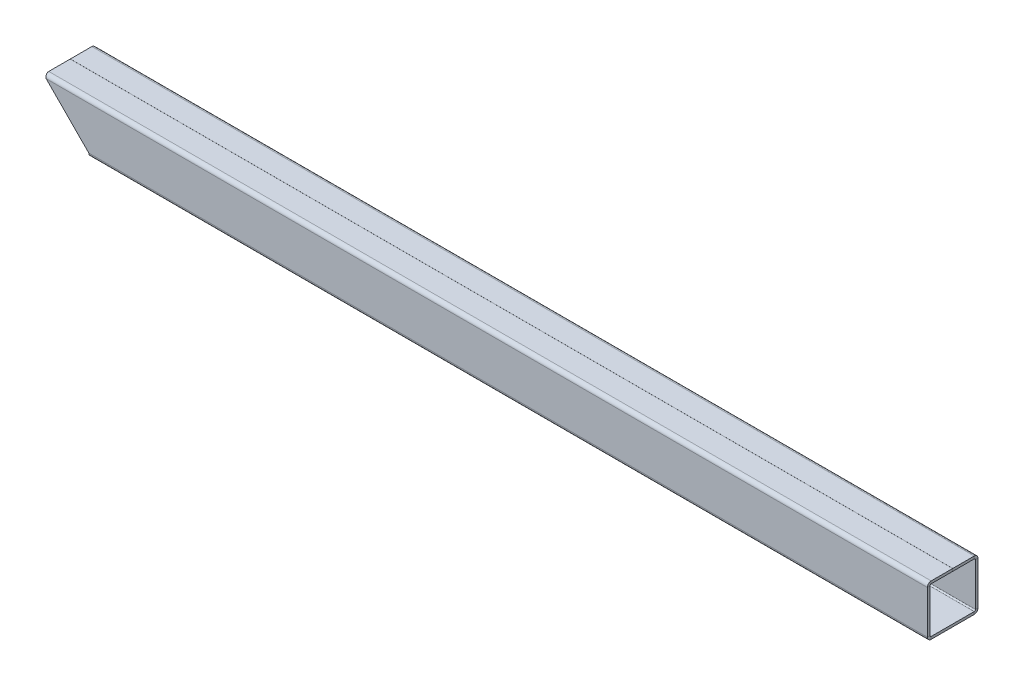
ISO-10303-21;
HEADER;
FILE_DESCRIPTION(('STEP AP214'),'2;1');
FILE_NAME('part.step','',(''),(''),'','','');
FILE_SCHEMA(('AUTOMOTIVE_DESIGN { 1 0 10303 214 1 1 1 1 }'));
ENDSEC;
DATA;
#1=APPLICATION_CONTEXT('core data for automotive mechanical design processes');
#2=APPLICATION_PROTOCOL_DEFINITION('international standard','automotive_design',2000,#1);
#3=PRODUCT_CONTEXT('',#1,'mechanical');
#4=PRODUCT('Part','Part','',(#3));
#5=PRODUCT_RELATED_PRODUCT_CATEGORY('part','',(#4));
#6=PRODUCT_DEFINITION_FORMATION('','',#4);
#7=PRODUCT_DEFINITION_CONTEXT('part definition',#1,'design');
#8=PRODUCT_DEFINITION('design','',#6,#7);
#9=PRODUCT_DEFINITION_SHAPE('','',#8);
#10=(LENGTH_UNIT() NAMED_UNIT(*) SI_UNIT(.MILLI.,.METRE.));
#11=(NAMED_UNIT(*) PLANE_ANGLE_UNIT() SI_UNIT($,.RADIAN.));
#12=(NAMED_UNIT(*) SI_UNIT($,.STERADIAN.) SOLID_ANGLE_UNIT());
#13=UNCERTAINTY_MEASURE_WITH_UNIT(LENGTH_MEASURE(1.E-05),#10,'distance_accuracy_value','');
#14=(GEOMETRIC_REPRESENTATION_CONTEXT(3) GLOBAL_UNCERTAINTY_ASSIGNED_CONTEXT((#13)) GLOBAL_UNIT_ASSIGNED_CONTEXT((#10,
#11,#12)) REPRESENTATION_CONTEXT('',''));
#15=CARTESIAN_POINT('',(0.,0.,0.));
#16=DIRECTION('',(0.,0.,1.));
#17=DIRECTION('',(1.,0.,0.));
#18=AXIS2_PLACEMENT_3D('',#15,#16,#17);
#19=CARTESIAN_POINT('',(349.75,18.,20.));
#20=DIRECTION('',(0.,1.,0.));
#21=DIRECTION('',(0.,0.,1.));
#22=AXIS2_PLACEMENT_3D('',#19,#20,#21);
#23=PLANE('',#22);
#24=DIRECTION('',(0.,0.,-1.));
#25=VECTOR('',#24,1.);
#26=CARTESIAN_POINT('',(-347.371621621622,18.,19.9999999999998));
#27=LINE('',#26,#25);
#28=CARTESIAN_POINT('',(-347.371621621622,18.,17.));
#29=VERTEX_POINT('',#28);
#30=CARTESIAN_POINT('',(-347.371621621622,18.,0.0249999999999938));
#31=VERTEX_POINT('',#30);
#32=EDGE_CURVE('E190',#29,#31,#27,.T.);
#33=ORIENTED_EDGE('',*,*,#32,.T.);
#34=DIRECTION('',(-1.,0.,0.));
#35=VECTOR('',#34,1.);
#36=CARTESIAN_POINT('',(349.75,18.,0.0249999999999938));
#37=LINE('',#36,#35);
#38=CARTESIAN_POINT('',(349.75,18.,0.0249999999999938));
#39=VERTEX_POINT('',#38);
#40=EDGE_CURVE('E266',#39,#31,#37,.T.);
#41=ORIENTED_EDGE('',*,*,#40,.F.);
#42=DIRECTION('',(0.,0.,-1.));
#43=VECTOR('',#42,1.);
#44=CARTESIAN_POINT('',(349.75,18.,20.));
#45=LINE('',#44,#43);
#46=CARTESIAN_POINT('',(349.75,18.,17.));
#47=VERTEX_POINT('',#46);
#48=EDGE_CURVE('E201',#47,#39,#45,.T.);
#49=ORIENTED_EDGE('',*,*,#48,.F.);
#50=DIRECTION('',(-1.,0.,0.));
#51=VECTOR('',#50,1.);
#52=CARTESIAN_POINT('',(349.75,18.,17.));
#53=LINE('',#52,#51);
#54=EDGE_CURVE('E349',#47,#29,#53,.T.);
#55=ORIENTED_EDGE('',*,*,#54,.T.);
#56=EDGE_LOOP('',(#33,#41,#49,#55));
#57=FACE_BOUND('',#56,.T.);
#58=ADVANCED_FACE('F42',(#57),#23,.F.);
#59=CARTESIAN_POINT('',(349.75,20.,0.0249999999999929));
#60=DIRECTION('',(0.,0.,-1.));
#61=DIRECTION('',(0.,1.,0.));
#62=AXIS2_PLACEMENT_3D('',#59,#60,#61);
#63=PLANE('',#62);
#64=ORIENTED_EDGE('',*,*,#40,.T.);
#65=DIRECTION('',(0.,-1.,0.));
#66=VECTOR('',#65,1.);
#67=CARTESIAN_POINT('',(-347.371621621622,18.,0.0249999999999938));
#68=LINE('',#67,#66);
#69=CARTESIAN_POINT('',(-347.371621621622,20.,0.0249999999999938));
#70=VERTEX_POINT('',#69);
#71=EDGE_CURVE('E368',#31,#70,#68,.F.);
#72=ORIENTED_EDGE('',*,*,#71,.T.);
#73=DIRECTION('',(-1.,0.,0.));
#74=VECTOR('',#73,1.);
#75=CARTESIAN_POINT('',(349.75,20.,0.0249999999999929));
#76=LINE('',#75,#74);
#77=CARTESIAN_POINT('',(349.75,20.,0.0249999999999929));
#78=VERTEX_POINT('',#77);
#79=EDGE_CURVE('E263',#78,#70,#76,.T.);
#80=ORIENTED_EDGE('',*,*,#79,.F.);
#81=DIRECTION('',(0.,-1.,0.));
#82=VECTOR('',#81,1.);
#83=CARTESIAN_POINT('',(349.75,20.,0.0249999999999929));
#84=LINE('',#83,#82);
#85=EDGE_CURVE('E387',#78,#39,#84,.T.);
#86=ORIENTED_EDGE('',*,*,#85,.T.);
#87=EDGE_LOOP('',(#64,#72,#80,#86));
#88=FACE_BOUND('',#87,.T.);
#89=ADVANCED_FACE('F398',(#88),#63,.T.);
#90=CARTESIAN_POINT('',(349.75,20.,20.));
#91=DIRECTION('',(0.,1.,0.));
#92=DIRECTION('',(0.,0.,1.));
#93=AXIS2_PLACEMENT_3D('',#90,#91,#92);
#94=PLANE('',#93);
#95=ORIENTED_EDGE('',*,*,#79,.T.);
#96=DIRECTION('',(0.,0.,1.));
#97=VECTOR('',#96,1.);
#98=CARTESIAN_POINT('',(-347.371621621622,20.,20.));
#99=LINE('',#98,#97);
#100=CARTESIAN_POINT('',(-347.371621621622,20.,17.));
#101=VERTEX_POINT('',#100);
#102=EDGE_CURVE('E376',#101,#70,#99,.F.);
#103=ORIENTED_EDGE('',*,*,#102,.F.);
#104=DIRECTION('',(-1.,0.,0.));
#105=VECTOR('',#104,1.);
#106=CARTESIAN_POINT('',(349.75,20.,17.));
#107=LINE('',#106,#105);
#108=CARTESIAN_POINT('',(349.75,20.,17.));
#109=VERTEX_POINT('',#108);
#110=EDGE_CURVE('E260',#109,#101,#107,.T.);
#111=ORIENTED_EDGE('',*,*,#110,.F.);
#112=DIRECTION('',(0.,0.,-1.));
#113=VECTOR('',#112,1.);
#114=CARTESIAN_POINT('',(349.75,20.,20.));
#115=LINE('',#114,#113);
#116=EDGE_CURVE('E303',#109,#78,#115,.T.);
#117=ORIENTED_EDGE('',*,*,#116,.T.);
#118=EDGE_LOOP('',(#95,#103,#111,#117));
#119=FACE_BOUND('',#118,.T.);
#120=ADVANCED_FACE('F391',(#119),#94,.T.);
#121=CARTESIAN_POINT('',(349.75,17.,17.));
#122=DIRECTION('',(-1.,0.,0.));
#123=DIRECTION('',(0.,0.,1.));
#124=AXIS2_PLACEMENT_3D('',#121,#122,#123);
#125=CYLINDRICAL_SURFACE('',#124,3.);
#126=ORIENTED_EDGE('',*,*,#110,.T.);
#127=CARTESIAN_POINT('',(-346.382432432432,17.,17.));
#128=DIRECTION('',(0.949705005976395,0.313145974943596,0.));
#129=DIRECTION('',(-0.313145974943596,0.949705005976395,0.));
#130=AXIS2_PLACEMENT_3D('',#127,#128,#129);
#131=ELLIPSE('',#130,3.15887563098153,3.);
#132=CARTESIAN_POINT('',(-346.382432432432,17.,20.));
#133=VERTEX_POINT('',#132);
#134=EDGE_CURVE('E299',#133,#101,#131,.F.);
#135=ORIENTED_EDGE('',*,*,#134,.F.);
#136=DIRECTION('',(-1.,0.,0.));
#137=VECTOR('',#136,1.);
#138=CARTESIAN_POINT('',(349.75,17.,20.));
#139=LINE('',#138,#137);
#140=CARTESIAN_POINT('',(349.75,17.,20.));
#141=VERTEX_POINT('',#140);
#142=EDGE_CURVE('E257',#141,#133,#139,.T.);
#143=ORIENTED_EDGE('',*,*,#142,.F.);
#144=CARTESIAN_POINT('',(349.75,17.,17.));
#145=DIRECTION('',(-1.,0.,0.));
#146=DIRECTION('',(0.,0.,1.));
#147=AXIS2_PLACEMENT_3D('',#144,#145,#146);
#148=CIRCLE('',#147,3.);
#149=EDGE_CURVE('E298',#141,#109,#148,.T.);
#150=ORIENTED_EDGE('',*,*,#149,.T.);
#151=EDGE_LOOP('',(#126,#135,#143,#150));
#152=FACE_BOUND('',#151,.T.);
#153=ADVANCED_FACE('F297',(#152),#125,.T.);
#154=CARTESIAN_POINT('',(349.75,20.,20.));
#155=DIRECTION('',(0.,0.,1.));
#156=DIRECTION('',(0.,-1.,0.));
#157=AXIS2_PLACEMENT_3D('',#154,#155,#156);
#158=PLANE('',#157);
#159=ORIENTED_EDGE('',*,*,#142,.T.);
#160=DIRECTION('',(0.703253423676687,-0.710939253443653,0.));
#161=VECTOR('',#160,1.);
#162=CARTESIAN_POINT('',(-349.35,20.,20.));
#163=LINE('',#162,#161);
#164=CARTESIAN_POINT('',(-312.75,-17.,20.));
#165=VERTEX_POINT('',#164);
#166=EDGE_CURVE('E364',#133,#165,#163,.T.);
#167=ORIENTED_EDGE('',*,*,#166,.T.);
#168=DIRECTION('',(-1.,0.,0.));
#169=VECTOR('',#168,1.);
#170=CARTESIAN_POINT('',(349.75,-17.,20.));
#171=LINE('',#170,#169);
#172=CARTESIAN_POINT('',(349.75,-17.,20.));
#173=VERTEX_POINT('',#172);
#174=EDGE_CURVE('E254',#173,#165,#171,.T.);
#175=ORIENTED_EDGE('',*,*,#174,.F.);
#176=DIRECTION('',(0.,1.,0.));
#177=VECTOR('',#176,1.);
#178=CARTESIAN_POINT('',(349.75,20.,20.));
#179=LINE('',#178,#177);
#180=EDGE_CURVE('E287',#173,#141,#179,.T.);
#181=ORIENTED_EDGE('',*,*,#180,.T.);
#182=EDGE_LOOP('',(#159,#167,#175,#181));
#183=FACE_BOUND('',#182,.T.);
#184=ADVANCED_FACE('F306',(#183),#158,.T.);
#185=CARTESIAN_POINT('',(349.75,-17.,17.));
#186=DIRECTION('',(-1.,0.,0.));
#187=DIRECTION('',(0.,0.,1.));
#188=AXIS2_PLACEMENT_3D('',#185,#186,#187);
#189=CYLINDRICAL_SURFACE('',#188,3.);
#190=ORIENTED_EDGE('',*,*,#174,.T.);
#191=CARTESIAN_POINT('',(-312.75,-17.,17.));
#192=DIRECTION('',(1.,0.,0.));
#193=DIRECTION('',(0.,0.,-1.));
#194=AXIS2_PLACEMENT_3D('',#191,#192,#193);
#195=CIRCLE('',#194,3.);
#196=CARTESIAN_POINT('',(-312.75,-20.,17.));
#197=VERTEX_POINT('',#196);
#198=EDGE_CURVE('E191',#197,#165,#195,.F.);
#199=ORIENTED_EDGE('',*,*,#198,.F.);
#200=DIRECTION('',(-1.,0.,0.));
#201=VECTOR('',#200,1.);
#202=CARTESIAN_POINT('',(349.75,-20.,17.));
#203=LINE('',#202,#201);
#204=CARTESIAN_POINT('',(349.75,-20.,17.));
#205=VERTEX_POINT('',#204);
#206=EDGE_CURVE('E251',#205,#197,#203,.T.);
#207=ORIENTED_EDGE('',*,*,#206,.F.);
#208=CARTESIAN_POINT('',(349.75,-17.,17.));
#209=DIRECTION('',(-1.,0.,0.));
#210=DIRECTION('',(0.,0.,1.));
#211=AXIS2_PLACEMENT_3D('',#208,#209,#210);
#212=CIRCLE('',#211,3.);
#213=EDGE_CURVE('E307',#205,#173,#212,.T.);
#214=ORIENTED_EDGE('',*,*,#213,.T.);
#215=EDGE_LOOP('',(#190,#199,#207,#214));
#216=FACE_BOUND('',#215,.T.);
#217=ADVANCED_FACE('F491',(#216),#189,.T.);
#218=CARTESIAN_POINT('',(349.75,-20.,20.));
#219=DIRECTION('',(0.,-1.,0.));
#220=DIRECTION('',(0.,0.,-1.));
#221=AXIS2_PLACEMENT_3D('',#218,#219,#220);
#222=PLANE('',#221);
#223=CARTESIAN_POINT('',(0.,-20.,0.));
#224=DIRECTION('',(0.,-1.,0.));
#225=DIRECTION('',(0.,0.,-1.));
#226=AXIS2_PLACEMENT_3D('',#223,#224,#225);
#227=CIRCLE('',#226,12.5);
#228=CARTESIAN_POINT('',(0.,-20.,-12.5));
#229=VERTEX_POINT('',#228);
#230=EDGE_CURVE('E886',#229,#229,#227,.T.);
#231=ORIENTED_EDGE('',*,*,#230,.F.);
#232=EDGE_LOOP('',(#231));
#233=FACE_BOUND('',#232,.T.);
#234=ORIENTED_EDGE('',*,*,#206,.T.);
#235=DIRECTION('',(0.,0.,-1.));
#236=VECTOR('',#235,1.);
#237=CARTESIAN_POINT('',(-312.75,-20.,20.));
#238=LINE('',#237,#236);
#239=CARTESIAN_POINT('',(-312.75,-20.,-17.));
#240=VERTEX_POINT('',#239);
#241=EDGE_CURVE('E200',#197,#240,#238,.T.);
#242=ORIENTED_EDGE('',*,*,#241,.T.);
#243=DIRECTION('',(-1.,0.,0.));
#244=VECTOR('',#243,1.);
#245=CARTESIAN_POINT('',(349.75,-20.,-17.));
#246=LINE('',#245,#244);
#247=CARTESIAN_POINT('',(349.75,-20.,-17.));
#248=VERTEX_POINT('',#247);
#249=EDGE_CURVE('E248',#248,#240,#246,.T.);
#250=ORIENTED_EDGE('',*,*,#249,.F.);
#251=DIRECTION('',(0.,0.,1.));
#252=VECTOR('',#251,1.);
#253=CARTESIAN_POINT('',(349.75,-20.,20.));
#254=LINE('',#253,#252);
#255=EDGE_CURVE('E309',#248,#205,#254,.T.);
#256=ORIENTED_EDGE('',*,*,#255,.T.);
#257=EDGE_LOOP('',(#234,#242,#250,#256));
#258=FACE_BOUND('',#257,.T.);
#259=ADVANCED_FACE('F487',(#233,#258),#222,.T.);
#260=CARTESIAN_POINT('',(349.75,-17.,-17.));
#261=DIRECTION('',(-1.,0.,0.));
#262=DIRECTION('',(0.,0.,1.));
#263=AXIS2_PLACEMENT_3D('',#260,#261,#262);
#264=CYLINDRICAL_SURFACE('',#263,3.);
#265=ORIENTED_EDGE('',*,*,#249,.T.);
#266=CARTESIAN_POINT('',(-312.75,-17.,-17.));
#267=DIRECTION('',(1.,0.,0.));
#268=DIRECTION('',(0.,0.,-1.));
#269=AXIS2_PLACEMENT_3D('',#266,#267,#268);
#270=CIRCLE('',#269,3.);
#271=CARTESIAN_POINT('',(-312.75,-17.,-20.));
#272=VERTEX_POINT('',#271);
#273=EDGE_CURVE('E876',#272,#240,#270,.F.);
#274=ORIENTED_EDGE('',*,*,#273,.F.);
#275=DIRECTION('',(-1.,0.,0.));
#276=VECTOR('',#275,1.);
#277=CARTESIAN_POINT('',(349.75,-17.,-20.));
#278=LINE('',#277,#276);
#279=CARTESIAN_POINT('',(349.75,-17.,-20.));
#280=VERTEX_POINT('',#279);
#281=EDGE_CURVE('E245',#280,#272,#278,.T.);
#282=ORIENTED_EDGE('',*,*,#281,.F.);
#283=CARTESIAN_POINT('',(349.75,-17.,-17.));
#284=DIRECTION('',(-1.,0.,0.));
#285=DIRECTION('',(0.,0.,1.));
#286=AXIS2_PLACEMENT_3D('',#283,#284,#285);
#287=CIRCLE('',#286,3.);
#288=EDGE_CURVE('E315',#280,#248,#287,.T.);
#289=ORIENTED_EDGE('',*,*,#288,.T.);
#290=EDGE_LOOP('',(#265,#274,#282,#289));
#291=FACE_BOUND('',#290,.T.);
#292=ADVANCED_FACE('F483',(#291),#264,.T.);
#293=CARTESIAN_POINT('',(349.75,20.,-20.));
#294=DIRECTION('',(0.,0.,-1.));
#295=DIRECTION('',(-1.,0.,0.));
#296=AXIS2_PLACEMENT_3D('',#293,#294,#295);
#297=PLANE('',#296);
#298=ORIENTED_EDGE('',*,*,#281,.T.);
#299=DIRECTION('',(0.703253423676687,-0.710939253443653,0.));
#300=VECTOR('',#299,1.);
#301=CARTESIAN_POINT('',(-3.59934430103487,-329.529351389668,-20.));
#302=LINE('',#301,#300);
#303=CARTESIAN_POINT('',(-346.382432432432,17.,-20.));
#304=VERTEX_POINT('',#303);
#305=EDGE_CURVE('E862',#304,#272,#302,.T.);
#306=ORIENTED_EDGE('',*,*,#305,.F.);
#307=DIRECTION('',(-1.,0.,0.));
#308=VECTOR('',#307,1.);
#309=CARTESIAN_POINT('',(349.75,17.,-20.));
#310=LINE('',#309,#308);
#311=CARTESIAN_POINT('',(349.75,17.,-20.));
#312=VERTEX_POINT('',#311);
#313=EDGE_CURVE('E242',#312,#304,#310,.T.);
#314=ORIENTED_EDGE('',*,*,#313,.F.);
#315=DIRECTION('',(0.,-1.,0.));
#316=VECTOR('',#315,1.);
#317=CARTESIAN_POINT('',(349.75,20.,-20.));
#318=LINE('',#317,#316);
#319=EDGE_CURVE('E318',#312,#280,#318,.T.);
#320=ORIENTED_EDGE('',*,*,#319,.T.);
#321=EDGE_LOOP('',(#298,#306,#314,#320));
#322=FACE_BOUND('',#321,.T.);
#323=ADVANCED_FACE('F479',(#322),#297,.T.);
#324=CARTESIAN_POINT('',(349.75,17.,-17.));
#325=DIRECTION('',(-1.,0.,0.));
#326=DIRECTION('',(0.,0.,1.));
#327=AXIS2_PLACEMENT_3D('',#324,#325,#326);
#328=CYLINDRICAL_SURFACE('',#327,3.);
#329=ORIENTED_EDGE('',*,*,#313,.T.);
#330=CARTESIAN_POINT('',(-346.382432432432,17.,-17.));
#331=DIRECTION('',(0.949705005976395,0.313145974943596,0.));
#332=DIRECTION('',(-0.313145974943596,0.949705005976395,0.));
#333=AXIS2_PLACEMENT_3D('',#330,#331,#332);
#334=ELLIPSE('',#333,3.15887563098153,3.);
#335=CARTESIAN_POINT('',(-347.371621621622,20.,-17.));
#336=VERTEX_POINT('',#335);
#337=EDGE_CURVE('E875',#336,#304,#334,.F.);
#338=ORIENTED_EDGE('',*,*,#337,.F.);
#339=DIRECTION('',(-1.,0.,0.));
#340=VECTOR('',#339,1.);
#341=CARTESIAN_POINT('',(349.75,20.,-17.));
#342=LINE('',#341,#340);
#343=CARTESIAN_POINT('',(349.75,20.,-17.));
#344=VERTEX_POINT('',#343);
#345=EDGE_CURVE('E239',#344,#336,#342,.T.);
#346=ORIENTED_EDGE('',*,*,#345,.F.);
#347=CARTESIAN_POINT('',(349.75,17.,-17.));
#348=DIRECTION('',(-1.,0.,0.));
#349=DIRECTION('',(0.,0.,1.));
#350=AXIS2_PLACEMENT_3D('',#347,#348,#349);
#351=CIRCLE('',#350,3.);
#352=EDGE_CURVE('E321',#344,#312,#351,.T.);
#353=ORIENTED_EDGE('',*,*,#352,.T.);
#354=EDGE_LOOP('',(#329,#338,#346,#353));
#355=FACE_BOUND('',#354,.T.);
#356=ADVANCED_FACE('F475',(#355),#328,.T.);
#357=CARTESIAN_POINT('',(349.75,20.,-0.0250000000000068));
#358=DIRECTION('',(0.,1.,0.));
#359=DIRECTION('',(0.,0.,1.));
#360=AXIS2_PLACEMENT_3D('',#357,#358,#359);
#361=PLANE('',#360);
#362=ORIENTED_EDGE('',*,*,#345,.T.);
#363=DIRECTION('',(0.,0.,1.));
#364=VECTOR('',#363,1.);
#365=CARTESIAN_POINT('',(-347.371621621622,20.,-0.0250000000000068));
#366=LINE('',#365,#364);
#367=CARTESIAN_POINT('',(-347.371621621622,20.,-0.0250000000000068));
#368=VERTEX_POINT('',#367);
#369=EDGE_CURVE('E855',#368,#336,#366,.F.);
#370=ORIENTED_EDGE('',*,*,#369,.F.);
#371=DIRECTION('',(-1.,0.,0.));
#372=VECTOR('',#371,1.);
#373=CARTESIAN_POINT('',(349.75,20.,-0.0250000000000068));
#374=LINE('',#373,#372);
#375=CARTESIAN_POINT('',(349.75,20.,-0.0250000000000068));
#376=VERTEX_POINT('',#375);
#377=EDGE_CURVE('E236',#376,#368,#374,.T.);
#378=ORIENTED_EDGE('',*,*,#377,.F.);
#379=DIRECTION('',(0.,0.,-1.));
#380=VECTOR('',#379,1.);
#381=CARTESIAN_POINT('',(349.75,20.,-0.0250000000000068));
#382=LINE('',#381,#380);
#383=EDGE_CURVE('E324',#376,#344,#382,.T.);
#384=ORIENTED_EDGE('',*,*,#383,.T.);
#385=EDGE_LOOP('',(#362,#370,#378,#384));
#386=FACE_BOUND('',#385,.T.);
#387=ADVANCED_FACE('F471',(#386),#361,.T.);
#388=CARTESIAN_POINT('',(349.75,18.,-0.0250000000000068));
#389=DIRECTION('',(0.,0.,1.));
#390=DIRECTION('',(1.,0.,0.));
#391=AXIS2_PLACEMENT_3D('',#388,#389,#390);
#392=PLANE('',#391);
#393=ORIENTED_EDGE('',*,*,#377,.T.);
#394=DIRECTION('',(0.,-1.,0.));
#395=VECTOR('',#394,1.);
#396=CARTESIAN_POINT('',(-347.371621621622,18.,-0.0250000000000068));
#397=LINE('',#396,#395);
#398=CARTESIAN_POINT('',(-347.371621621622,18.,-0.0250000000000068));
#399=VERTEX_POINT('',#398);
#400=EDGE_CURVE('E854',#399,#368,#397,.F.);
#401=ORIENTED_EDGE('',*,*,#400,.F.);
#402=DIRECTION('',(-1.,0.,0.));
#403=VECTOR('',#402,1.);
#404=CARTESIAN_POINT('',(349.75,18.,-0.0250000000000068));
#405=LINE('',#404,#403);
#406=CARTESIAN_POINT('',(349.75,18.,-0.0250000000000068));
#407=VERTEX_POINT('',#406);
#408=EDGE_CURVE('E233',#407,#399,#405,.T.);
#409=ORIENTED_EDGE('',*,*,#408,.F.);
#410=DIRECTION('',(0.,1.,0.));
#411=VECTOR('',#410,1.);
#412=CARTESIAN_POINT('',(349.75,18.,-0.0250000000000068));
#413=LINE('',#412,#411);
#414=EDGE_CURVE('E327',#407,#376,#413,.T.);
#415=ORIENTED_EDGE('',*,*,#414,.T.);
#416=EDGE_LOOP('',(#393,#401,#409,#415));
#417=FACE_BOUND('',#416,.T.);
#418=ADVANCED_FACE('F467',(#417),#392,.T.);
#419=CARTESIAN_POINT('',(349.75,18.,-0.0250000000000068));
#420=DIRECTION('',(0.,1.,0.));
#421=DIRECTION('',(0.,0.,1.));
#422=AXIS2_PLACEMENT_3D('',#419,#420,#421);
#423=PLANE('',#422);
#424=DIRECTION('',(0.,0.,-1.));
#425=VECTOR('',#424,1.);
#426=CARTESIAN_POINT('',(-347.371621621622,18.,-0.0250000000001663));
#427=LINE('',#426,#425);
#428=CARTESIAN_POINT('',(-347.371621621622,18.,-17.));
#429=VERTEX_POINT('',#428);
#430=EDGE_CURVE('E846',#399,#429,#427,.T.);
#431=ORIENTED_EDGE('',*,*,#430,.T.);
#432=DIRECTION('',(-1.,0.,0.));
#433=VECTOR('',#432,1.);
#434=CARTESIAN_POINT('',(349.75,18.,-17.));
#435=LINE('',#434,#433);
#436=CARTESIAN_POINT('',(349.75,18.,-17.));
#437=VERTEX_POINT('',#436);
#438=EDGE_CURVE('E230',#437,#429,#435,.T.);
#439=ORIENTED_EDGE('',*,*,#438,.F.);
#440=DIRECTION('',(0.,0.,-1.));
#441=VECTOR('',#440,1.);
#442=CARTESIAN_POINT('',(349.75,18.,-0.0250000000000068));
#443=LINE('',#442,#441);
#444=EDGE_CURVE('E330',#407,#437,#443,.T.);
#445=ORIENTED_EDGE('',*,*,#444,.F.);
#446=ORIENTED_EDGE('',*,*,#408,.T.);
#447=EDGE_LOOP('',(#431,#439,#445,#446));
#448=FACE_BOUND('',#447,.T.);
#449=ADVANCED_FACE('F463',(#448),#423,.F.);
#450=CARTESIAN_POINT('',(349.75,17.,-17.));
#451=DIRECTION('',(-1.,0.,0.));
#452=DIRECTION('',(0.,0.,1.));
#453=AXIS2_PLACEMENT_3D('',#450,#451,#452);
#454=CYLINDRICAL_SURFACE('',#453,1.);
#455=CARTESIAN_POINT('',(-346.382432432432,17.,-17.));
#456=DIRECTION('',(0.710939253443653,0.703253423676687,0.));
#457=DIRECTION('',(-0.703253423676687,0.710939253443653,0.));
#458=AXIS2_PLACEMENT_3D('',#455,#456,#457);
#459=ELLIPSE('',#458,1.40658993740491,1.);
#460=CARTESIAN_POINT('',(-346.382432432432,17.,-18.));
#461=VERTEX_POINT('',#460);
#462=EDGE_CURVE('E877',#429,#461,#459,.F.);
#463=ORIENTED_EDGE('',*,*,#462,.T.);
#464=DIRECTION('',(-1.,0.,0.));
#465=VECTOR('',#464,1.);
#466=CARTESIAN_POINT('',(349.75,17.,-18.));
#467=LINE('',#466,#465);
#468=CARTESIAN_POINT('',(349.75,17.,-18.));
#469=VERTEX_POINT('',#468);
#470=EDGE_CURVE('E227',#469,#461,#467,.T.);
#471=ORIENTED_EDGE('',*,*,#470,.F.);
#472=CARTESIAN_POINT('',(349.75,17.,-17.));
#473=DIRECTION('',(1.,0.,0.));
#474=DIRECTION('',(0.,0.,-1.));
#475=AXIS2_PLACEMENT_3D('',#472,#473,#474);
#476=CIRCLE('',#475,1.);
#477=EDGE_CURVE('E333',#437,#469,#476,.F.);
#478=ORIENTED_EDGE('',*,*,#477,.F.);
#479=ORIENTED_EDGE('',*,*,#438,.T.);
#480=EDGE_LOOP('',(#463,#471,#478,#479));
#481=FACE_BOUND('',#480,.T.);
#482=ADVANCED_FACE('F459',(#481),#454,.F.);
#483=CARTESIAN_POINT('',(349.75,20.,-18.));
#484=DIRECTION('',(0.,0.,-1.));
#485=DIRECTION('',(-1.,0.,0.));
#486=AXIS2_PLACEMENT_3D('',#483,#484,#485);
#487=PLANE('',#486);
#488=DIRECTION('',(0.703253423676687,-0.710939253443653,0.));
#489=VECTOR('',#488,1.);
#490=CARTESIAN_POINT('',(-3.59934430103487,-329.529351389668,-18.));
#491=LINE('',#490,#489);
#492=CARTESIAN_POINT('',(-312.75,-17.,-18.));
#493=VERTEX_POINT('',#492);
#494=EDGE_CURVE('E374',#461,#493,#491,.T.);
#495=ORIENTED_EDGE('',*,*,#494,.T.);
#496=DIRECTION('',(-1.,0.,0.));
#497=VECTOR('',#496,1.);
#498=CARTESIAN_POINT('',(349.75,-17.,-18.));
#499=LINE('',#498,#497);
#500=CARTESIAN_POINT('',(349.75,-17.,-18.));
#501=VERTEX_POINT('',#500);
#502=EDGE_CURVE('E219',#501,#493,#499,.T.);
#503=ORIENTED_EDGE('',*,*,#502,.F.);
#504=DIRECTION('',(0.,1.,0.));
#505=VECTOR('',#504,1.);
#506=CARTESIAN_POINT('',(349.75,20.,-18.));
#507=LINE('',#506,#505);
#508=EDGE_CURVE('E336',#469,#501,#507,.F.);
#509=ORIENTED_EDGE('',*,*,#508,.F.);
#510=ORIENTED_EDGE('',*,*,#470,.T.);
#511=EDGE_LOOP('',(#495,#503,#509,#510));
#512=FACE_BOUND('',#511,.T.);
#513=ADVANCED_FACE('F455',(#512),#487,.F.);
#514=CARTESIAN_POINT('',(349.75,-17.,-17.));
#515=DIRECTION('',(-1.,0.,0.));
#516=DIRECTION('',(0.,0.,1.));
#517=AXIS2_PLACEMENT_3D('',#514,#515,#516);
#518=CYLINDRICAL_SURFACE('',#517,1.);
#519=CARTESIAN_POINT('',(-312.75,-17.,-17.));
#520=DIRECTION('',(-1.,0.,0.));
#521=DIRECTION('',(0.,0.,1.));
#522=AXIS2_PLACEMENT_3D('',#519,#520,#521);
#523=CIRCLE('',#522,1.);
#524=CARTESIAN_POINT('',(-312.75,-18.,-17.));
#525=VERTEX_POINT('',#524);
#526=EDGE_CURVE('E879',#493,#525,#523,.T.);
#527=ORIENTED_EDGE('',*,*,#526,.T.);
#528=DIRECTION('',(-1.,0.,0.));
#529=VECTOR('',#528,1.);
#530=CARTESIAN_POINT('',(349.75,-18.,-17.));
#531=LINE('',#530,#529);
#532=CARTESIAN_POINT('',(349.75,-18.,-17.));
#533=VERTEX_POINT('',#532);
#534=EDGE_CURVE('E212',#533,#525,#531,.T.);
#535=ORIENTED_EDGE('',*,*,#534,.F.);
#536=CARTESIAN_POINT('',(349.75,-17.,-17.));
#537=DIRECTION('',(1.,0.,0.));
#538=DIRECTION('',(0.,0.,-1.));
#539=AXIS2_PLACEMENT_3D('',#536,#537,#538);
#540=CIRCLE('',#539,1.);
#541=EDGE_CURVE('E339',#501,#533,#540,.F.);
#542=ORIENTED_EDGE('',*,*,#541,.F.);
#543=ORIENTED_EDGE('',*,*,#502,.T.);
#544=EDGE_LOOP('',(#527,#535,#542,#543));
#545=FACE_BOUND('',#544,.T.);
#546=ADVANCED_FACE('F451',(#545),#518,.F.);
#547=CARTESIAN_POINT('',(349.75,-18.,20.));
#548=DIRECTION('',(0.,-1.,0.));
#549=DIRECTION('',(0.,0.,-1.));
#550=AXIS2_PLACEMENT_3D('',#547,#548,#549);
#551=PLANE('',#550);
#552=CARTESIAN_POINT('',(0.,-18.,0.));
#553=DIRECTION('',(0.,-1.,0.));
#554=DIRECTION('',(0.,0.,-1.));
#555=AXIS2_PLACEMENT_3D('',#552,#553,#554);
#556=CIRCLE('',#555,12.5);
#557=CARTESIAN_POINT('',(0.,-18.,-12.5));
#558=VERTEX_POINT('',#557);
#559=EDGE_CURVE('E46',#558,#558,#556,.T.);
#560=ORIENTED_EDGE('',*,*,#559,.T.);
#561=EDGE_LOOP('',(#560));
#562=FACE_BOUND('',#561,.T.);
#563=DIRECTION('',(0.,0.,-1.));
#564=VECTOR('',#563,1.);
#565=CARTESIAN_POINT('',(-312.75,-18.,20.));
#566=LINE('',#565,#564);
#567=CARTESIAN_POINT('',(-312.75,-18.,17.));
#568=VERTEX_POINT('',#567);
#569=EDGE_CURVE('E197',#568,#525,#566,.T.);
#570=ORIENTED_EDGE('',*,*,#569,.F.);
#571=DIRECTION('',(-1.,0.,0.));
#572=VECTOR('',#571,1.);
#573=CARTESIAN_POINT('',(349.75,-18.,17.));
#574=LINE('',#573,#572);
#575=CARTESIAN_POINT('',(349.75,-18.,17.));
#576=VERTEX_POINT('',#575);
#577=EDGE_CURVE('E209',#576,#568,#574,.T.);
#578=ORIENTED_EDGE('',*,*,#577,.F.);
#579=DIRECTION('',(0.,0.,-1.));
#580=VECTOR('',#579,1.);
#581=CARTESIAN_POINT('',(349.75,-18.,20.));
#582=LINE('',#581,#580);
#583=EDGE_CURVE('E342',#533,#576,#582,.F.);
#584=ORIENTED_EDGE('',*,*,#583,.F.);
#585=ORIENTED_EDGE('',*,*,#534,.T.);
#586=EDGE_LOOP('',(#570,#578,#584,#585));
#587=FACE_BOUND('',#586,.T.);
#588=ADVANCED_FACE('F207',(#562,#587),#551,.F.);
#589=CARTESIAN_POINT('',(349.75,-17.,17.));
#590=DIRECTION('',(-1.,0.,0.));
#591=DIRECTION('',(0.,0.,1.));
#592=AXIS2_PLACEMENT_3D('',#589,#590,#591);
#593=CYLINDRICAL_SURFACE('',#592,1.);
#594=CARTESIAN_POINT('',(-312.75,-17.,17.));
#595=DIRECTION('',(-1.,0.,0.));
#596=DIRECTION('',(0.,0.,1.));
#597=AXIS2_PLACEMENT_3D('',#594,#595,#596);
#598=CIRCLE('',#597,1.);
#599=CARTESIAN_POINT('',(-312.75,-17.,18.));
#600=VERTEX_POINT('',#599);
#601=EDGE_CURVE('E179',#568,#600,#598,.T.);
#602=ORIENTED_EDGE('',*,*,#601,.T.);
#603=DIRECTION('',(-1.,0.,0.));
#604=VECTOR('',#603,1.);
#605=CARTESIAN_POINT('',(349.75,-17.,18.));
#606=LINE('',#605,#604);
#607=CARTESIAN_POINT('',(349.75,-17.,18.));
#608=VERTEX_POINT('',#607);
#609=EDGE_CURVE('E217',#608,#600,#606,.T.);
#610=ORIENTED_EDGE('',*,*,#609,.F.);
#611=CARTESIAN_POINT('',(349.75,-17.,17.));
#612=DIRECTION('',(1.,0.,0.));
#613=DIRECTION('',(0.,0.,-1.));
#614=AXIS2_PLACEMENT_3D('',#611,#612,#613);
#615=CIRCLE('',#614,1.);
#616=EDGE_CURVE('E216',#576,#608,#615,.F.);
#617=ORIENTED_EDGE('',*,*,#616,.F.);
#618=ORIENTED_EDGE('',*,*,#577,.T.);
#619=EDGE_LOOP('',(#602,#610,#617,#618));
#620=FACE_BOUND('',#619,.T.);
#621=ADVANCED_FACE('F214',(#620),#593,.F.);
#622=CARTESIAN_POINT('',(349.75,20.,18.));
#623=DIRECTION('',(0.,0.,1.));
#624=DIRECTION('',(0.,-1.,0.));
#625=AXIS2_PLACEMENT_3D('',#622,#623,#624);
#626=PLANE('',#625);
#627=DIRECTION('',(0.703253423676687,-0.710939253443653,0.));
#628=VECTOR('',#627,1.);
#629=CARTESIAN_POINT('',(-349.35,20.,18.));
#630=LINE('',#629,#628);
#631=CARTESIAN_POINT('',(-346.382432432432,17.,18.));
#632=VERTEX_POINT('',#631);
#633=EDGE_CURVE('E361',#632,#600,#630,.T.);
#634=ORIENTED_EDGE('',*,*,#633,.F.);
#635=DIRECTION('',(-1.,0.,0.));
#636=VECTOR('',#635,1.);
#637=CARTESIAN_POINT('',(349.75,17.,18.));
#638=LINE('',#637,#636);
#639=CARTESIAN_POINT('',(349.75,17.,18.));
#640=VERTEX_POINT('',#639);
#641=EDGE_CURVE('E221',#640,#632,#638,.T.);
#642=ORIENTED_EDGE('',*,*,#641,.F.);
#643=DIRECTION('',(0.,1.,0.));
#644=VECTOR('',#643,1.);
#645=CARTESIAN_POINT('',(349.75,20.,18.));
#646=LINE('',#645,#644);
#647=EDGE_CURVE('E290',#608,#640,#646,.T.);
#648=ORIENTED_EDGE('',*,*,#647,.F.);
#649=ORIENTED_EDGE('',*,*,#609,.T.);
#650=EDGE_LOOP('',(#634,#642,#648,#649));
#651=FACE_BOUND('',#650,.T.);
#652=ADVANCED_FACE('F360',(#651),#626,.F.);
#653=CARTESIAN_POINT('',(349.75,17.,17.));
#654=DIRECTION('',(-1.,0.,0.));
#655=DIRECTION('',(0.,0.,1.));
#656=AXIS2_PLACEMENT_3D('',#653,#654,#655);
#657=CYLINDRICAL_SURFACE('',#656,1.);
#658=CARTESIAN_POINT('',(-346.382432432432,17.,17.));
#659=DIRECTION('',(0.710939253443653,0.703253423676687,0.));
#660=DIRECTION('',(-0.703253423676687,0.710939253443653,0.));
#661=AXIS2_PLACEMENT_3D('',#658,#659,#660);
#662=ELLIPSE('',#661,1.40658993740491,1.);
#663=EDGE_CURVE('E357',#632,#29,#662,.F.);
#664=ORIENTED_EDGE('',*,*,#663,.T.);
#665=ORIENTED_EDGE('',*,*,#54,.F.);
#666=CARTESIAN_POINT('',(349.75,17.,17.));
#667=DIRECTION('',(1.,0.,0.));
#668=DIRECTION('',(0.,0.,-1.));
#669=AXIS2_PLACEMENT_3D('',#666,#667,#668);
#670=CIRCLE('',#669,1.);
#671=EDGE_CURVE('E347',#640,#47,#670,.F.);
#672=ORIENTED_EDGE('',*,*,#671,.F.);
#673=ORIENTED_EDGE('',*,*,#641,.T.);
#674=EDGE_LOOP('',(#664,#665,#672,#673));
#675=FACE_BOUND('',#674,.T.);
#676=ADVANCED_FACE('F355',(#675),#657,.F.);
#677=CARTESIAN_POINT('',(349.75,20.,17.));
#678=DIRECTION('',(1.,0.,0.));
#679=DIRECTION('',(0.,0.,-1.));
#680=AXIS2_PLACEMENT_3D('',#677,#678,#679);
#681=PLANE('',#680);
#682=DIRECTION('',(0.,-1.,0.));
#683=VECTOR('',#682,1.);
#684=CARTESIAN_POINT('',(349.75,20.,17.));
#685=LINE('',#684,#683);
#686=EDGE_CURVE('E11',#109,#47,#685,.T.);
#687=ORIENTED_EDGE('',*,*,#686,.F.);
#688=ORIENTED_EDGE('',*,*,#149,.F.);
#689=DIRECTION('',(0.,0.,1.));
#690=VECTOR('',#689,1.);
#691=CARTESIAN_POINT('',(349.75,17.,18.));
#692=LINE('',#691,#690);
#693=EDGE_CURVE('E51',#640,#141,#692,.T.);
#694=ORIENTED_EDGE('',*,*,#693,.F.);
#695=ORIENTED_EDGE('',*,*,#671,.T.);
#696=EDGE_LOOP('',(#687,#688,#694,#695));
#697=FACE_BOUND('',#696,.T.);
#698=ADVANCED_FACE('F44',(#697),#681,.T.);
#699=CARTESIAN_POINT('',(349.75,17.,18.));
#700=DIRECTION('',(1.,0.,0.));
#701=DIRECTION('',(0.,0.,-1.));
#702=AXIS2_PLACEMENT_3D('',#699,#700,#701);
#703=PLANE('',#702);
#704=ORIENTED_EDGE('',*,*,#116,.F.);
#705=ORIENTED_EDGE('',*,*,#686,.T.);
#706=ORIENTED_EDGE('',*,*,#48,.T.);
#707=ORIENTED_EDGE('',*,*,#85,.F.);
#708=EDGE_LOOP('',(#704,#705,#706,#707));
#709=FACE_BOUND('',#708,.T.);
#710=ADVANCED_FACE('F394',(#709),#703,.T.);
#711=CARTESIAN_POINT('',(349.75,-17.,20.));
#712=DIRECTION('',(1.,0.,0.));
#713=DIRECTION('',(0.,0.,-1.));
#714=AXIS2_PLACEMENT_3D('',#711,#712,#713);
#715=PLANE('',#714);
#716=DIRECTION('',(0.,0.,-1.));
#717=VECTOR('',#716,1.);
#718=CARTESIAN_POINT('',(349.75,-17.,20.));
#719=LINE('',#718,#717);
#720=EDGE_CURVE('E279',#173,#608,#719,.T.);
#721=ORIENTED_EDGE('',*,*,#720,.F.);
#722=ORIENTED_EDGE('',*,*,#213,.F.);
#723=DIRECTION('',(0.,-1.,0.));
#724=VECTOR('',#723,1.);
#725=CARTESIAN_POINT('',(349.75,-18.,17.));
#726=LINE('',#725,#724);
#727=EDGE_CURVE('E277',#576,#205,#726,.T.);
#728=ORIENTED_EDGE('',*,*,#727,.F.);
#729=ORIENTED_EDGE('',*,*,#616,.T.);
#730=EDGE_LOOP('',(#721,#722,#728,#729));
#731=FACE_BOUND('',#730,.T.);
#732=ADVANCED_FACE('F429',(#731),#715,.T.);
#733=CARTESIAN_POINT('',(349.75,-18.,17.));
#734=DIRECTION('',(1.,0.,0.));
#735=DIRECTION('',(0.,0.,-1.));
#736=AXIS2_PLACEMENT_3D('',#733,#734,#735);
#737=PLANE('',#736);
#738=ORIENTED_EDGE('',*,*,#180,.F.);
#739=ORIENTED_EDGE('',*,*,#720,.T.);
#740=ORIENTED_EDGE('',*,*,#647,.T.);
#741=ORIENTED_EDGE('',*,*,#693,.T.);
#742=EDGE_LOOP('',(#738,#739,#740,#741));
#743=FACE_BOUND('',#742,.T.);
#744=ADVANCED_FACE('F285',(#743),#737,.T.);
#745=CARTESIAN_POINT('',(349.75,-20.,-17.));
#746=DIRECTION('',(1.,0.,0.));
#747=DIRECTION('',(0.,0.,-1.));
#748=AXIS2_PLACEMENT_3D('',#745,#746,#747);
#749=PLANE('',#748);
#750=DIRECTION('',(0.,1.,0.));
#751=VECTOR('',#750,1.);
#752=CARTESIAN_POINT('',(349.75,-20.,-17.));
#753=LINE('',#752,#751);
#754=EDGE_CURVE('E275',#248,#533,#753,.T.);
#755=ORIENTED_EDGE('',*,*,#754,.F.);
#756=ORIENTED_EDGE('',*,*,#288,.F.);
#757=DIRECTION('',(0.,0.,-1.));
#758=VECTOR('',#757,1.);
#759=CARTESIAN_POINT('',(349.75,-17.,-18.));
#760=LINE('',#759,#758);
#761=EDGE_CURVE('E273',#501,#280,#760,.T.);
#762=ORIENTED_EDGE('',*,*,#761,.F.);
#763=ORIENTED_EDGE('',*,*,#541,.T.);
#764=EDGE_LOOP('',(#755,#756,#762,#763));
#765=FACE_BOUND('',#764,.T.);
#766=ADVANCED_FACE('F422',(#765),#749,.T.);
#767=CARTESIAN_POINT('',(349.75,-17.,-18.));
#768=DIRECTION('',(1.,0.,0.));
#769=DIRECTION('',(0.,0.,-1.));
#770=AXIS2_PLACEMENT_3D('',#767,#768,#769);
#771=PLANE('',#770);
#772=ORIENTED_EDGE('',*,*,#255,.F.);
#773=ORIENTED_EDGE('',*,*,#754,.T.);
#774=ORIENTED_EDGE('',*,*,#583,.T.);
#775=ORIENTED_EDGE('',*,*,#727,.T.);
#776=EDGE_LOOP('',(#772,#773,#774,#775));
#777=FACE_BOUND('',#776,.T.);
#778=ADVANCED_FACE('F418',(#777),#771,.T.);
#779=CARTESIAN_POINT('',(349.75,17.,-20.));
#780=DIRECTION('',(1.,0.,0.));
#781=DIRECTION('',(0.,0.,-1.));
#782=AXIS2_PLACEMENT_3D('',#779,#780,#781);
#783=PLANE('',#782);
#784=DIRECTION('',(0.,0.,1.));
#785=VECTOR('',#784,1.);
#786=CARTESIAN_POINT('',(349.75,17.,-20.));
#787=LINE('',#786,#785);
#788=EDGE_CURVE('E271',#312,#469,#787,.T.);
#789=ORIENTED_EDGE('',*,*,#788,.F.);
#790=ORIENTED_EDGE('',*,*,#352,.F.);
#791=DIRECTION('',(0.,1.,0.));
#792=VECTOR('',#791,1.);
#793=CARTESIAN_POINT('',(349.75,18.,-17.));
#794=LINE('',#793,#792);
#795=EDGE_CURVE('E269',#437,#344,#794,.T.);
#796=ORIENTED_EDGE('',*,*,#795,.F.);
#797=ORIENTED_EDGE('',*,*,#477,.T.);
#798=EDGE_LOOP('',(#789,#790,#796,#797));
#799=FACE_BOUND('',#798,.T.);
#800=ADVANCED_FACE('F414',(#799),#783,.T.);
#801=CARTESIAN_POINT('',(349.75,18.,-17.));
#802=DIRECTION('',(1.,0.,0.));
#803=DIRECTION('',(0.,0.,-1.));
#804=AXIS2_PLACEMENT_3D('',#801,#802,#803);
#805=PLANE('',#804);
#806=ORIENTED_EDGE('',*,*,#319,.F.);
#807=ORIENTED_EDGE('',*,*,#788,.T.);
#808=ORIENTED_EDGE('',*,*,#508,.T.);
#809=ORIENTED_EDGE('',*,*,#761,.T.);
#810=EDGE_LOOP('',(#806,#807,#808,#809));
#811=FACE_BOUND('',#810,.T.);
#812=ADVANCED_FACE('F410',(#811),#805,.T.);
#813=CARTESIAN_POINT('',(349.75,17.,17.));
#814=DIRECTION('',(-1.,0.,0.));
#815=DIRECTION('',(0.,0.,1.));
#816=AXIS2_PLACEMENT_3D('',#813,#814,#815);
#817=PLANE('',#816);
#818=ORIENTED_EDGE('',*,*,#444,.T.);
#819=ORIENTED_EDGE('',*,*,#795,.T.);
#820=ORIENTED_EDGE('',*,*,#383,.F.);
#821=ORIENTED_EDGE('',*,*,#414,.F.);
#822=EDGE_LOOP('',(#818,#819,#820,#821));
#823=FACE_BOUND('',#822,.T.);
#824=ADVANCED_FACE('F413',(#823),#817,.F.);
#825=CARTESIAN_POINT('',(-347.371621621622,18.,-0.0250000000001663));
#826=DIRECTION('',(1.,0.,0.));
#827=DIRECTION('',(0.,0.,-1.));
#828=AXIS2_PLACEMENT_3D('',#825,#826,#827);
#829=PLANE('',#828);
#830=DIRECTION('',(0.,-1.,0.));
#831=VECTOR('',#830,1.);
#832=CARTESIAN_POINT('',(-347.371621621622,18.,-17.));
#833=LINE('',#832,#831);
#834=EDGE_CURVE('E383',#429,#336,#833,.F.);
#835=ORIENTED_EDGE('',*,*,#834,.F.);
#836=ORIENTED_EDGE('',*,*,#430,.F.);
#837=ORIENTED_EDGE('',*,*,#400,.T.);
#838=ORIENTED_EDGE('',*,*,#369,.T.);
#839=EDGE_LOOP('',(#835,#836,#837,#838));
#840=FACE_BOUND('',#839,.T.);
#841=ADVANCED_FACE('F580',(#840),#829,.F.);
#842=CARTESIAN_POINT('',(-347.371621621622,20.,-17.));
#843=CARTESIAN_POINT('',(-347.371621621622,19.3333333333333,-17.));
#844=CARTESIAN_POINT('',(-347.371621621622,18.6666666666667,-17.));
#845=CARTESIAN_POINT('',(-347.371621621622,18.,-17.));
#846=CARTESIAN_POINT('',(-347.371621621622,20.,-23.));
#847=CARTESIAN_POINT('',(-347.371621621622,19.3333333333333,-21.6666666666667));
#848=CARTESIAN_POINT('',(-347.371621621622,18.6666666666667,-20.3333333333333));
#849=CARTESIAN_POINT('',(-347.371621621622,18.,-19.));
#850=CARTESIAN_POINT('',(-345.393243243243,14.,-23.));
#851=CARTESIAN_POINT('',(-345.393243243243,14.6666666666667,-21.6666666666667));
#852=CARTESIAN_POINT('',(-345.393243243243,15.3333333333333,-20.3333333333333));
#853=CARTESIAN_POINT('',(-345.393243243243,16.,-19.));
#854=CARTESIAN_POINT('',(-345.393243243243,14.,-17.));
#855=CARTESIAN_POINT('',(-345.393243243243,14.6666666666667,-17.));
#856=CARTESIAN_POINT('',(-345.393243243243,15.3333333333333,-17.));
#857=CARTESIAN_POINT('',(-345.393243243243,16.,-17.));
#858=CARTESIAN_POINT('',(-345.393243243243,14.,-11.));
#859=CARTESIAN_POINT('',(-345.393243243243,14.6666666666667,-12.3333333333333));
#860=CARTESIAN_POINT('',(-345.393243243243,15.3333333333333,-13.6666666666667));
#861=CARTESIAN_POINT('',(-345.393243243243,16.,-15.));
#862=CARTESIAN_POINT('',(-347.371621621622,20.,-11.));
#863=CARTESIAN_POINT('',(-347.371621621622,19.3333333333333,-12.3333333333333));
#864=CARTESIAN_POINT('',(-347.371621621622,18.6666666666667,-13.6666666666667));
#865=CARTESIAN_POINT('',(-347.371621621622,18.,-15.));
#866=CARTESIAN_POINT('',(-347.371621621622,20.,-17.));
#867=CARTESIAN_POINT('',(-347.371621621622,19.3333333333333,-17.));
#868=CARTESIAN_POINT('',(-347.371621621622,18.6666666666667,-17.));
#869=CARTESIAN_POINT('',(-347.371621621622,18.,-17.));
#870=(BOUNDED_SURFACE() B_SPLINE_SURFACE(3,3,((#842,#843,#844,#845),(#846,#847,#848,#849),(#850,
#851,#852,#853),(#854,#855,#856,#857),(#858,#859,#860,#861),(#862,#863,#864,#865),(#866,#867,
#868,#869)),.UNSPECIFIED.,.T.,.F.,.F.) B_SPLINE_SURFACE_WITH_KNOTS((4,3,4),(4,4),(0.,0.5,1.),
(0.,1.),.UNSPECIFIED.) GEOMETRIC_REPRESENTATION_ITEM() RATIONAL_B_SPLINE_SURFACE(((1.,1.,1.,1.),
(0.333333333333333,0.333333333333333,0.333333333333333,0.333333333333333),(0.333333333333333,
0.333333333333333,0.333333333333333,0.333333333333333),(1.,1.,1.,1.),(0.333333333333333,
0.333333333333333,0.333333333333333,0.333333333333333),(0.333333333333333,0.333333333333333,
0.333333333333333,0.333333333333333),(1.,1.,1.,1.))) REPRESENTATION_ITEM('') SURFACE());
#871=DIRECTION('',(0.,0.,1.));
#872=VECTOR('',#871,1.);
#873=CARTESIAN_POINT('',(-346.382432432432,17.,-18.));
#874=LINE('',#873,#872);
#875=EDGE_CURVE('E371',#461,#304,#874,.F.);
#876=ORIENTED_EDGE('',*,*,#875,.F.);
#877=ORIENTED_EDGE('',*,*,#462,.F.);
#878=ORIENTED_EDGE('',*,*,#834,.T.);
#879=ORIENTED_EDGE('',*,*,#337,.T.);
#880=EDGE_LOOP('',(#876,#877,#878,#879));
#881=FACE_BOUND('',#880,.T.);
#882=ADVANCED_FACE('F585',(#881),#870,.T.);
#883=CARTESIAN_POINT('',(-3.59934430103487,-329.529351389668,-18.));
#884=DIRECTION('',(0.710939253443653,0.703253423676687,0.));
#885=DIRECTION('',(0.703253423676687,-0.710939253443653,0.));
#886=AXIS2_PLACEMENT_3D('',#883,#884,#885);
#887=PLANE('',#886);
#888=DIRECTION('',(0.,0.,1.));
#889=VECTOR('',#888,1.);
#890=CARTESIAN_POINT('',(-312.75,-17.,-18.));
#891=LINE('',#890,#889);
#892=EDGE_CURVE('E865',#493,#272,#891,.F.);
#893=ORIENTED_EDGE('',*,*,#892,.F.);
#894=ORIENTED_EDGE('',*,*,#494,.F.);
#895=ORIENTED_EDGE('',*,*,#875,.T.);
#896=ORIENTED_EDGE('',*,*,#305,.T.);
#897=EDGE_LOOP('',(#893,#894,#895,#896));
#898=FACE_BOUND('',#897,.T.);
#899=ADVANCED_FACE('F598',(#898),#887,.F.);
#900=CARTESIAN_POINT('',(-312.75,-17.,-17.));
#901=DIRECTION('',(-1.,0.,0.));
#902=DIRECTION('',(0.,0.,1.));
#903=AXIS2_PLACEMENT_3D('',#900,#901,#902);
#904=PLANE('',#903);
#905=ORIENTED_EDGE('',*,*,#273,.T.);
#906=DIRECTION('',(0.,-1.,0.));
#907=VECTOR('',#906,1.);
#908=CARTESIAN_POINT('',(-312.75,-20.,-17.));
#909=LINE('',#908,#907);
#910=EDGE_CURVE('E202',#240,#525,#909,.F.);
#911=ORIENTED_EDGE('',*,*,#910,.T.);
#912=ORIENTED_EDGE('',*,*,#526,.F.);
#913=ORIENTED_EDGE('',*,*,#892,.T.);
#914=EDGE_LOOP('',(#905,#911,#912,#913));
#915=FACE_BOUND('',#914,.T.);
#916=ADVANCED_FACE('F609',(#915),#904,.T.);
#917=CARTESIAN_POINT('',(-312.75,-20.,20.));
#918=DIRECTION('',(-1.,0.,0.));
#919=DIRECTION('',(0.,0.,-1.));
#920=AXIS2_PLACEMENT_3D('',#917,#918,#919);
#921=PLANE('',#920);
#922=ORIENTED_EDGE('',*,*,#241,.F.);
#923=DIRECTION('',(0.,-1.,0.));
#924=VECTOR('',#923,1.);
#925=CARTESIAN_POINT('',(-312.75,-20.,17.));
#926=LINE('',#925,#924);
#927=EDGE_CURVE('E182',#197,#568,#926,.F.);
#928=ORIENTED_EDGE('',*,*,#927,.T.);
#929=ORIENTED_EDGE('',*,*,#569,.T.);
#930=ORIENTED_EDGE('',*,*,#910,.F.);
#931=EDGE_LOOP('',(#922,#928,#929,#930));
#932=FACE_BOUND('',#931,.T.);
#933=ADVANCED_FACE('F195',(#932),#921,.T.);
#934=CARTESIAN_POINT('',(-347.371621621622,18.,19.9999999999998));
#935=DIRECTION('',(1.,0.,0.));
#936=DIRECTION('',(0.,0.,-1.));
#937=AXIS2_PLACEMENT_3D('',#934,#935,#936);
#938=PLANE('',#937);
#939=ORIENTED_EDGE('',*,*,#71,.F.);
#940=ORIENTED_EDGE('',*,*,#32,.F.);
#941=DIRECTION('',(0.,-1.,0.));
#942=VECTOR('',#941,1.);
#943=CARTESIAN_POINT('',(-347.371621621622,18.,17.));
#944=LINE('',#943,#942);
#945=EDGE_CURVE('E58',#29,#101,#944,.F.);
#946=ORIENTED_EDGE('',*,*,#945,.T.);
#947=ORIENTED_EDGE('',*,*,#102,.T.);
#948=EDGE_LOOP('',(#939,#940,#946,#947));
#949=FACE_BOUND('',#948,.T.);
#950=ADVANCED_FACE('F400',(#949),#938,.F.);
#951=CARTESIAN_POINT('',(-347.371621621622,20.,17.));
#952=CARTESIAN_POINT('',(-347.371621621622,19.3333333333333,17.));
#953=CARTESIAN_POINT('',(-347.371621621622,18.6666666666667,17.));
#954=CARTESIAN_POINT('',(-347.371621621622,18.,17.));
#955=CARTESIAN_POINT('',(-347.371621621622,20.,11.));
#956=CARTESIAN_POINT('',(-347.371621621622,19.3333333333333,12.3333333333333));
#957=CARTESIAN_POINT('',(-347.371621621622,18.6666666666667,13.6666666666667));
#958=CARTESIAN_POINT('',(-347.371621621622,18.,15.));
#959=CARTESIAN_POINT('',(-345.393243243243,14.,11.));
#960=CARTESIAN_POINT('',(-345.393243243243,14.6666666666667,12.3333333333333));
#961=CARTESIAN_POINT('',(-345.393243243243,15.3333333333333,13.6666666666667));
#962=CARTESIAN_POINT('',(-345.393243243243,16.,15.));
#963=CARTESIAN_POINT('',(-345.393243243243,14.,17.));
#964=CARTESIAN_POINT('',(-345.393243243243,14.6666666666667,17.));
#965=CARTESIAN_POINT('',(-345.393243243243,15.3333333333333,17.));
#966=CARTESIAN_POINT('',(-345.393243243243,16.,17.));
#967=CARTESIAN_POINT('',(-345.393243243243,14.,23.));
#968=CARTESIAN_POINT('',(-345.393243243243,14.6666666666667,21.6666666666667));
#969=CARTESIAN_POINT('',(-345.393243243243,15.3333333333333,20.3333333333333));
#970=CARTESIAN_POINT('',(-345.393243243243,16.,19.));
#971=CARTESIAN_POINT('',(-347.371621621622,20.,23.));
#972=CARTESIAN_POINT('',(-347.371621621622,19.3333333333333,21.6666666666667));
#973=CARTESIAN_POINT('',(-347.371621621622,18.6666666666667,20.3333333333333));
#974=CARTESIAN_POINT('',(-347.371621621622,18.,19.));
#975=CARTESIAN_POINT('',(-347.371621621622,20.,17.));
#976=CARTESIAN_POINT('',(-347.371621621622,19.3333333333333,17.));
#977=CARTESIAN_POINT('',(-347.371621621622,18.6666666666667,17.));
#978=CARTESIAN_POINT('',(-347.371621621622,18.,17.));
#979=(BOUNDED_SURFACE() B_SPLINE_SURFACE(3,3,((#951,#952,#953,#954),(#955,#956,#957,#958),(#959,
#960,#961,#962),(#963,#964,#965,#966),(#967,#968,#969,#970),(#971,#972,#973,#974),(#975,#976,
#977,#978)),.UNSPECIFIED.,.T.,.F.,.F.) B_SPLINE_SURFACE_WITH_KNOTS((4,3,4),(4,4),(0.,0.5,1.),
(0.,1.),.UNSPECIFIED.) GEOMETRIC_REPRESENTATION_ITEM() RATIONAL_B_SPLINE_SURFACE(((1.,1.,1.,1.),
(0.333333333333333,0.333333333333333,0.333333333333333,0.333333333333333),(0.333333333333333,
0.333333333333333,0.333333333333333,0.333333333333333),(1.,1.,1.,1.),(0.333333333333333,
0.333333333333333,0.333333333333333,0.333333333333333),(0.333333333333333,0.333333333333333,
0.333333333333333,0.333333333333333),(1.,1.,1.,1.))) REPRESENTATION_ITEM('') SURFACE());
#980=DIRECTION('',(0.,0.,1.));
#981=VECTOR('',#980,1.);
#982=CARTESIAN_POINT('',(-346.382432432432,17.,20.));
#983=LINE('',#982,#981);
#984=EDGE_CURVE('E366',#133,#632,#983,.F.);
#985=ORIENTED_EDGE('',*,*,#945,.F.);
#986=ORIENTED_EDGE('',*,*,#663,.F.);
#987=ORIENTED_EDGE('',*,*,#984,.F.);
#988=ORIENTED_EDGE('',*,*,#134,.T.);
#989=EDGE_LOOP('',(#985,#986,#987,#988));
#990=FACE_BOUND('',#989,.T.);
#991=ADVANCED_FACE('F638',(#990),#979,.T.);
#992=CARTESIAN_POINT('',(-349.35,20.,20.));
#993=DIRECTION('',(-0.710939253443653,-0.703253423676687,0.));
#994=DIRECTION('',(0.703253423676687,-0.710939253443653,0.));
#995=AXIS2_PLACEMENT_3D('',#992,#993,#994);
#996=PLANE('',#995);
#997=ORIENTED_EDGE('',*,*,#166,.F.);
#998=ORIENTED_EDGE('',*,*,#984,.T.);
#999=ORIENTED_EDGE('',*,*,#633,.T.);
#1000=DIRECTION('',(0.,0.,1.));
#1001=VECTOR('',#1000,1.);
#1002=CARTESIAN_POINT('',(-312.75,-17.,20.));
#1003=LINE('',#1002,#1001);
#1004=EDGE_CURVE('E185',#165,#600,#1003,.F.);
#1005=ORIENTED_EDGE('',*,*,#1004,.F.);
#1006=EDGE_LOOP('',(#997,#998,#999,#1005));
#1007=FACE_BOUND('',#1006,.T.);
#1008=ADVANCED_FACE('F648',(#1007),#996,.T.);
#1009=CARTESIAN_POINT('',(-312.75,-17.,17.));
#1010=DIRECTION('',(-1.,0.,0.));
#1011=DIRECTION('',(0.,0.,1.));
#1012=AXIS2_PLACEMENT_3D('',#1009,#1010,#1011);
#1013=PLANE('',#1012);
#1014=ORIENTED_EDGE('',*,*,#198,.T.);
#1015=ORIENTED_EDGE('',*,*,#1004,.T.);
#1016=ORIENTED_EDGE('',*,*,#601,.F.);
#1017=ORIENTED_EDGE('',*,*,#927,.F.);
#1018=EDGE_LOOP('',(#1014,#1015,#1016,#1017));
#1019=FACE_BOUND('',#1018,.T.);
#1020=ADVANCED_FACE('F181',(#1019),#1013,.T.);
#1021=CARTESIAN_POINT('',(0.,-10.,0.));
#1022=DIRECTION('',(0.,-1.,0.));
#1023=DIRECTION('',(0.,0.,-1.));
#1024=AXIS2_PLACEMENT_3D('',#1021,#1022,#1023);
#1025=CYLINDRICAL_SURFACE('',#1024,12.5);
#1026=ORIENTED_EDGE('',*,*,#230,.T.);
#1027=EDGE_LOOP('',(#1026));
#1028=FACE_BOUND('',#1027,.T.);
#1029=ORIENTED_EDGE('',*,*,#559,.F.);
#1030=EDGE_LOOP('',(#1029));
#1031=FACE_BOUND('',#1030,.T.);
#1032=ADVANCED_FACE('F665',(#1028,#1031),#1025,.F.);
#1033=CLOSED_SHELL('',(#58,#89,#120,#153,#184,#217,#259,#292,#323,#356,#387,#418,#449,#482,#513,
#546,#588,#621,#652,#676,#698,#710,#732,#744,#766,#778,#800,#812,#824,#841,#882,#899,#916,#933,
#950,#991,#1008,#1020,#1032));
#1034=MANIFOLD_SOLID_BREP('B2',#1033);
#1035=ADVANCED_BREP_SHAPE_REPRESENTATION('',(#18,#1034),#14);
#1036=SHAPE_DEFINITION_REPRESENTATION(#9,#1035);
ENDSEC;
END-ISO-10303-21;
